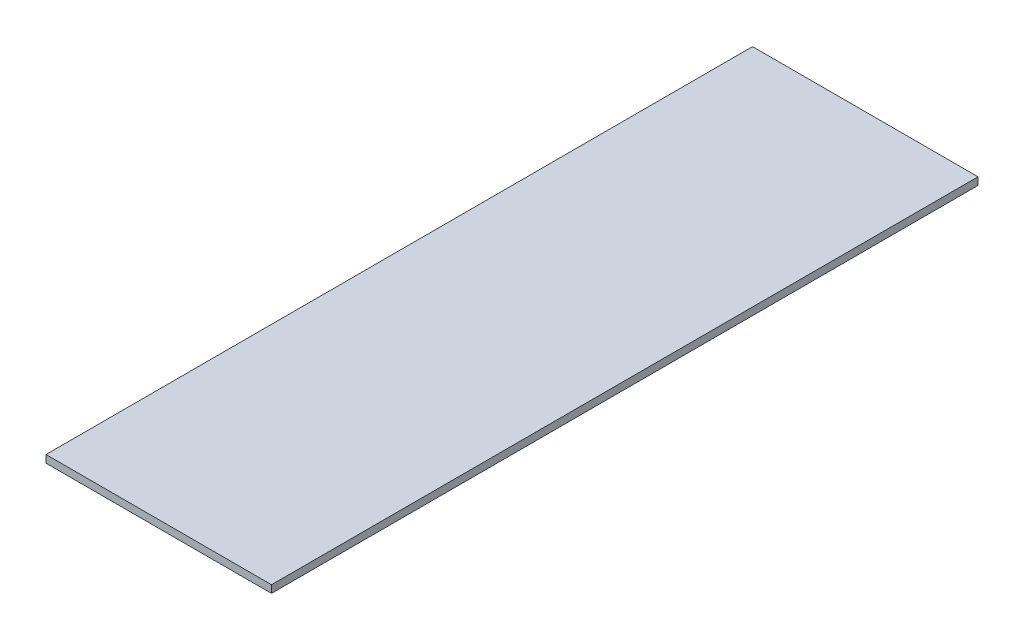
ISO-10303-21;
HEADER;
FILE_DESCRIPTION(('STEP AP214'),'2;1');
FILE_NAME('part.step','',(''),(''),'','','');
FILE_SCHEMA(('AUTOMOTIVE_DESIGN { 1 0 10303 214 1 1 1 1 }'));
ENDSEC;
DATA;
#1=APPLICATION_CONTEXT('core data for automotive mechanical design processes');
#2=APPLICATION_PROTOCOL_DEFINITION('international standard','automotive_design',2000,#1);
#3=PRODUCT_CONTEXT('',#1,'mechanical');
#4=PRODUCT('Part','Part','',(#3));
#5=PRODUCT_RELATED_PRODUCT_CATEGORY('part','',(#4));
#6=PRODUCT_DEFINITION_FORMATION('','',#4);
#7=PRODUCT_DEFINITION_CONTEXT('part definition',#1,'design');
#8=PRODUCT_DEFINITION('design','',#6,#7);
#9=PRODUCT_DEFINITION_SHAPE('','',#8);
#10=(LENGTH_UNIT() NAMED_UNIT(*) SI_UNIT(.MILLI.,.METRE.));
#11=(NAMED_UNIT(*) PLANE_ANGLE_UNIT() SI_UNIT($,.RADIAN.));
#12=(NAMED_UNIT(*) SI_UNIT($,.STERADIAN.) SOLID_ANGLE_UNIT());
#13=UNCERTAINTY_MEASURE_WITH_UNIT(LENGTH_MEASURE(1.E-05),#10,'distance_accuracy_value','');
#14=(GEOMETRIC_REPRESENTATION_CONTEXT(3) GLOBAL_UNCERTAINTY_ASSIGNED_CONTEXT((#13)) GLOBAL_UNIT_ASSIGNED_CONTEXT((#10,
#11,#12)) REPRESENTATION_CONTEXT('',''));
#15=CARTESIAN_POINT('',(0.,0.,0.));
#16=DIRECTION('',(0.,0.,1.));
#17=DIRECTION('',(1.,0.,0.));
#18=AXIS2_PLACEMENT_3D('',#15,#16,#17);
#19=CARTESIAN_POINT('',(29.03,1.52,14.48));
#20=DIRECTION('',(0.,1.,0.));
#21=DIRECTION('',(0.,0.,1.));
#22=AXIS2_PLACEMENT_3D('',#19,#20,#21);
#23=PLANE('',#22);
#24=DIRECTION('',(0.,0.,1.));
#25=VECTOR('',#24,1.);
#26=CARTESIAN_POINT('',(28.28,1.52,12.13));
#27=LINE('',#26,#25);
#28=CARTESIAN_POINT('',(28.28,1.52,12.13));
#29=VERTEX_POINT('',#28);
#30=CARTESIAN_POINT('',(28.28,1.52,16.83));
#31=VERTEX_POINT('',#30);
#32=EDGE_CURVE('E79',#29,#31,#27,.T.);
#33=ORIENTED_EDGE('',*,*,#32,.F.);
#34=DIRECTION('',(-1.,0.,0.));
#35=VECTOR('',#34,1.);
#36=CARTESIAN_POINT('',(29.78,1.52,12.13));
#37=LINE('',#36,#35);
#38=CARTESIAN_POINT('',(29.78,1.52,12.13));
#39=VERTEX_POINT('',#38);
#40=EDGE_CURVE('E55',#39,#29,#37,.T.);
#41=ORIENTED_EDGE('',*,*,#40,.F.);
#42=DIRECTION('',(0.,0.,-1.));
#43=VECTOR('',#42,1.);
#44=CARTESIAN_POINT('',(29.78,1.52,16.83));
#45=LINE('',#44,#43);
#46=CARTESIAN_POINT('',(29.78,1.52,16.83));
#47=VERTEX_POINT('',#46);
#48=EDGE_CURVE('E57',#47,#39,#45,.T.);
#49=ORIENTED_EDGE('',*,*,#48,.F.);
#50=DIRECTION('',(1.,0.,0.));
#51=VECTOR('',#50,1.);
#52=CARTESIAN_POINT('',(28.28,1.52,16.83));
#53=LINE('',#52,#51);
#54=EDGE_CURVE('E20',#31,#47,#53,.T.);
#55=ORIENTED_EDGE('',*,*,#54,.F.);
#56=EDGE_LOOP('',(#33,#41,#49,#55));
#57=FACE_BOUND('',#56,.T.);
#58=ADVANCED_FACE('F17',(#57),#23,.F.);
#59=CARTESIAN_POINT('',(28.28,1.52,16.83));
#60=DIRECTION('',(0.,0.,1.));
#61=DIRECTION('',(1.,0.,0.));
#62=AXIS2_PLACEMENT_3D('',#59,#60,#61);
#63=PLANE('',#62);
#64=DIRECTION('',(1.,0.,0.));
#65=VECTOR('',#64,1.);
#66=CARTESIAN_POINT('',(29.03,1.57,16.83));
#67=LINE('',#66,#65);
#68=CARTESIAN_POINT('',(28.28,1.57,16.83));
#69=VERTEX_POINT('',#68);
#70=CARTESIAN_POINT('',(29.78,1.57,16.83));
#71=VERTEX_POINT('',#70);
#72=EDGE_CURVE('E83',#69,#71,#67,.T.);
#73=ORIENTED_EDGE('',*,*,#72,.F.);
#74=DIRECTION('',(0.,1.,0.));
#75=VECTOR('',#74,1.);
#76=CARTESIAN_POINT('',(28.28,1.52,16.83));
#77=LINE('',#76,#75);
#78=EDGE_CURVE('E68',#31,#69,#77,.T.);
#79=ORIENTED_EDGE('',*,*,#78,.F.);
#80=ORIENTED_EDGE('',*,*,#54,.T.);
#81=DIRECTION('',(0.,1.,0.));
#82=VECTOR('',#81,1.);
#83=CARTESIAN_POINT('',(29.78,1.52,16.83));
#84=LINE('',#83,#82);
#85=EDGE_CURVE('E63',#71,#47,#84,.F.);
#86=ORIENTED_EDGE('',*,*,#85,.F.);
#87=EDGE_LOOP('',(#73,#79,#80,#86));
#88=FACE_BOUND('',#87,.T.);
#89=ADVANCED_FACE('F65',(#88),#63,.T.);
#90=CARTESIAN_POINT('',(29.78,1.52,16.83));
#91=DIRECTION('',(1.,0.,0.));
#92=DIRECTION('',(0.,0.,-1.));
#93=AXIS2_PLACEMENT_3D('',#90,#91,#92);
#94=PLANE('',#93);
#95=DIRECTION('',(0.,0.,1.));
#96=VECTOR('',#95,1.);
#97=CARTESIAN_POINT('',(29.78,1.57,14.48));
#98=LINE('',#97,#96);
#99=CARTESIAN_POINT('',(29.78,1.57,12.13));
#100=VERTEX_POINT('',#99);
#101=EDGE_CURVE('E72',#71,#100,#98,.F.);
#102=ORIENTED_EDGE('',*,*,#101,.F.);
#103=ORIENTED_EDGE('',*,*,#85,.T.);
#104=ORIENTED_EDGE('',*,*,#48,.T.);
#105=DIRECTION('',(0.,1.,0.));
#106=VECTOR('',#105,1.);
#107=CARTESIAN_POINT('',(29.78,1.52,12.13));
#108=LINE('',#107,#106);
#109=EDGE_CURVE('E75',#100,#39,#108,.F.);
#110=ORIENTED_EDGE('',*,*,#109,.F.);
#111=EDGE_LOOP('',(#102,#103,#104,#110));
#112=FACE_BOUND('',#111,.T.);
#113=ADVANCED_FACE('F70',(#112),#94,.T.);
#114=CARTESIAN_POINT('',(29.78,1.52,12.13));
#115=DIRECTION('',(0.,0.,-1.));
#116=DIRECTION('',(-1.,0.,0.));
#117=AXIS2_PLACEMENT_3D('',#114,#115,#116);
#118=PLANE('',#117);
#119=DIRECTION('',(1.,0.,0.));
#120=VECTOR('',#119,1.);
#121=CARTESIAN_POINT('',(29.03,1.57,12.13));
#122=LINE('',#121,#120);
#123=CARTESIAN_POINT('',(28.28,1.57,12.13));
#124=VERTEX_POINT('',#123);
#125=EDGE_CURVE('E26',#100,#124,#122,.F.);
#126=ORIENTED_EDGE('',*,*,#125,.F.);
#127=ORIENTED_EDGE('',*,*,#109,.T.);
#128=ORIENTED_EDGE('',*,*,#40,.T.);
#129=DIRECTION('',(0.,1.,0.));
#130=VECTOR('',#129,1.);
#131=CARTESIAN_POINT('',(28.28,1.52,12.13));
#132=LINE('',#131,#130);
#133=EDGE_CURVE('E35',#124,#29,#132,.F.);
#134=ORIENTED_EDGE('',*,*,#133,.F.);
#135=EDGE_LOOP('',(#126,#127,#128,#134));
#136=FACE_BOUND('',#135,.T.);
#137=ADVANCED_FACE('F89',(#136),#118,.T.);
#138=CARTESIAN_POINT('',(28.28,1.52,12.13));
#139=DIRECTION('',(-1.,0.,0.));
#140=DIRECTION('',(0.,0.,1.));
#141=AXIS2_PLACEMENT_3D('',#138,#139,#140);
#142=PLANE('',#141);
#143=DIRECTION('',(0.,0.,1.));
#144=VECTOR('',#143,1.);
#145=CARTESIAN_POINT('',(28.28,1.57,14.48));
#146=LINE('',#145,#144);
#147=EDGE_CURVE('E11',#124,#69,#146,.T.);
#148=ORIENTED_EDGE('',*,*,#147,.F.);
#149=ORIENTED_EDGE('',*,*,#133,.T.);
#150=ORIENTED_EDGE('',*,*,#32,.T.);
#151=ORIENTED_EDGE('',*,*,#78,.T.);
#152=EDGE_LOOP('',(#148,#149,#150,#151));
#153=FACE_BOUND('',#152,.T.);
#154=ADVANCED_FACE('F91',(#153),#142,.T.);
#155=CARTESIAN_POINT('',(29.03,1.57,14.48));
#156=DIRECTION('',(0.,1.,0.));
#157=DIRECTION('',(0.,0.,1.));
#158=AXIS2_PLACEMENT_3D('',#155,#156,#157);
#159=PLANE('',#158);
#160=ORIENTED_EDGE('',*,*,#125,.T.);
#161=ORIENTED_EDGE('',*,*,#147,.T.);
#162=ORIENTED_EDGE('',*,*,#72,.T.);
#163=ORIENTED_EDGE('',*,*,#101,.T.);
#164=EDGE_LOOP('',(#160,#161,#162,#163));
#165=FACE_BOUND('',#164,.T.);
#166=ADVANCED_FACE('F88',(#165),#159,.T.);
#167=CLOSED_SHELL('',(#58,#89,#113,#137,#154,#166));
#168=MANIFOLD_SOLID_BREP('B1',#167);
#169=ADVANCED_BREP_SHAPE_REPRESENTATION('',(#18,#168),#14);
#170=SHAPE_DEFINITION_REPRESENTATION(#9,#169);
ENDSEC;
END-ISO-10303-21;
